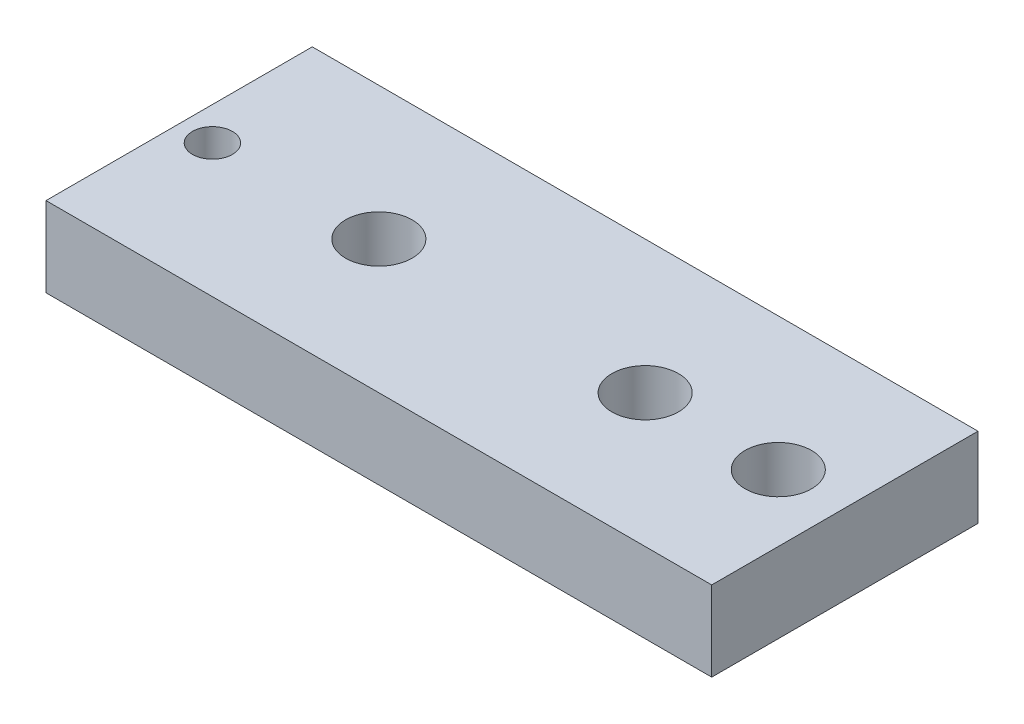
ISO-10303-21;
HEADER;
FILE_DESCRIPTION(('STEP AP214'),'2;1');
FILE_NAME('part.step','',(''),(''),'','','');
FILE_SCHEMA(('AUTOMOTIVE_DESIGN { 1 0 10303 214 1 1 1 1 }'));
ENDSEC;
DATA;
#1=APPLICATION_CONTEXT('core data for automotive mechanical design processes');
#2=APPLICATION_PROTOCOL_DEFINITION('international standard','automotive_design',2000,#1);
#3=PRODUCT_CONTEXT('',#1,'mechanical');
#4=PRODUCT('Part','Part','',(#3));
#5=PRODUCT_RELATED_PRODUCT_CATEGORY('part','',(#4));
#6=PRODUCT_DEFINITION_FORMATION('','',#4);
#7=PRODUCT_DEFINITION_CONTEXT('part definition',#1,'design');
#8=PRODUCT_DEFINITION('design','',#6,#7);
#9=PRODUCT_DEFINITION_SHAPE('','',#8);
#10=(LENGTH_UNIT() NAMED_UNIT(*) SI_UNIT(.MILLI.,.METRE.));
#11=(NAMED_UNIT(*) PLANE_ANGLE_UNIT() SI_UNIT($,.RADIAN.));
#12=(NAMED_UNIT(*) SI_UNIT($,.STERADIAN.) SOLID_ANGLE_UNIT());
#13=UNCERTAINTY_MEASURE_WITH_UNIT(LENGTH_MEASURE(1.E-05),#10,'distance_accuracy_value','');
#14=(GEOMETRIC_REPRESENTATION_CONTEXT(3) GLOBAL_UNCERTAINTY_ASSIGNED_CONTEXT((#13)) GLOBAL_UNIT_ASSIGNED_CONTEXT((#10,
#11,#12)) REPRESENTATION_CONTEXT('',''));
#15=CARTESIAN_POINT('',(0.,0.,0.));
#16=DIRECTION('',(0.,0.,1.));
#17=DIRECTION('',(1.,0.,0.));
#18=AXIS2_PLACEMENT_3D('',#15,#16,#17);
#19=CARTESIAN_POINT('',(-25.,6.,10.));
#20=DIRECTION('',(-1.,0.,0.));
#21=DIRECTION('',(0.,0.,1.));
#22=AXIS2_PLACEMENT_3D('',#19,#20,#21);
#23=PLANE('',#22);
#24=DIRECTION('',(0.,0.,-1.));
#25=VECTOR('',#24,1.);
#26=CARTESIAN_POINT('',(-25.,0.,10.));
#27=LINE('',#26,#25);
#28=CARTESIAN_POINT('',(-25.,0.,10.));
#29=VERTEX_POINT('',#28);
#30=CARTESIAN_POINT('',(-25.,0.,-10.));
#31=VERTEX_POINT('',#30);
#32=EDGE_CURVE('E99',#29,#31,#27,.T.);
#33=ORIENTED_EDGE('',*,*,#32,.F.);
#34=DIRECTION('',(0.,-1.,0.));
#35=VECTOR('',#34,1.);
#36=CARTESIAN_POINT('',(-25.,6.,10.));
#37=LINE('',#36,#35);
#38=CARTESIAN_POINT('',(-25.,6.,10.));
#39=VERTEX_POINT('',#38);
#40=EDGE_CURVE('E11',#39,#29,#37,.T.);
#41=ORIENTED_EDGE('',*,*,#40,.F.);
#42=DIRECTION('',(0.,0.,-1.));
#43=VECTOR('',#42,1.);
#44=CARTESIAN_POINT('',(-25.,6.,10.));
#45=LINE('',#44,#43);
#46=CARTESIAN_POINT('',(-25.,6.,-10.));
#47=VERTEX_POINT('',#46);
#48=EDGE_CURVE('E93',#39,#47,#45,.T.);
#49=ORIENTED_EDGE('',*,*,#48,.T.);
#50=DIRECTION('',(0.,-1.,0.));
#51=VECTOR('',#50,1.);
#52=CARTESIAN_POINT('',(-25.,6.,-10.));
#53=LINE('',#52,#51);
#54=EDGE_CURVE('E36',#47,#31,#53,.T.);
#55=ORIENTED_EDGE('',*,*,#54,.T.);
#56=EDGE_LOOP('',(#33,#41,#49,#55));
#57=FACE_BOUND('',#56,.T.);
#58=ADVANCED_FACE('F33',(#57),#23,.T.);
#59=CARTESIAN_POINT('',(-25.,6.,10.));
#60=DIRECTION('',(0.,0.,-1.));
#61=DIRECTION('',(-1.,0.,0.));
#62=AXIS2_PLACEMENT_3D('',#59,#60,#61);
#63=PLANE('',#62);
#64=DIRECTION('',(1.,0.,0.));
#65=VECTOR('',#64,1.);
#66=CARTESIAN_POINT('',(-25.,0.,10.));
#67=LINE('',#66,#65);
#68=CARTESIAN_POINT('',(25.,0.,10.));
#69=VERTEX_POINT('',#68);
#70=EDGE_CURVE('E66',#29,#69,#67,.T.);
#71=ORIENTED_EDGE('',*,*,#70,.T.);
#72=DIRECTION('',(0.,-1.,0.));
#73=VECTOR('',#72,1.);
#74=CARTESIAN_POINT('',(25.,6.,10.));
#75=LINE('',#74,#73);
#76=CARTESIAN_POINT('',(25.,6.,10.));
#77=VERTEX_POINT('',#76);
#78=EDGE_CURVE('E42',#77,#69,#75,.T.);
#79=ORIENTED_EDGE('',*,*,#78,.F.);
#80=DIRECTION('',(1.,0.,0.));
#81=VECTOR('',#80,1.);
#82=CARTESIAN_POINT('',(-25.,6.,10.));
#83=LINE('',#82,#81);
#84=EDGE_CURVE('E83',#39,#77,#83,.T.);
#85=ORIENTED_EDGE('',*,*,#84,.F.);
#86=ORIENTED_EDGE('',*,*,#40,.T.);
#87=EDGE_LOOP('',(#71,#79,#85,#86));
#88=FACE_BOUND('',#87,.T.);
#89=ADVANCED_FACE('F110',(#88),#63,.F.);
#90=CARTESIAN_POINT('',(25.,6.,10.));
#91=DIRECTION('',(-1.,0.,0.));
#92=DIRECTION('',(0.,0.,1.));
#93=AXIS2_PLACEMENT_3D('',#90,#91,#92);
#94=PLANE('',#93);
#95=DIRECTION('',(0.,0.,-1.));
#96=VECTOR('',#95,1.);
#97=CARTESIAN_POINT('',(25.,0.,10.));
#98=LINE('',#97,#96);
#99=CARTESIAN_POINT('',(25.,0.,-10.));
#100=VERTEX_POINT('',#99);
#101=EDGE_CURVE('E90',#69,#100,#98,.T.);
#102=ORIENTED_EDGE('',*,*,#101,.T.);
#103=DIRECTION('',(0.,-1.,0.));
#104=VECTOR('',#103,1.);
#105=CARTESIAN_POINT('',(25.,6.,-10.));
#106=LINE('',#105,#104);
#107=CARTESIAN_POINT('',(25.,6.,-10.));
#108=VERTEX_POINT('',#107);
#109=EDGE_CURVE('E87',#108,#100,#106,.T.);
#110=ORIENTED_EDGE('',*,*,#109,.F.);
#111=DIRECTION('',(0.,0.,-1.));
#112=VECTOR('',#111,1.);
#113=CARTESIAN_POINT('',(25.,6.,10.));
#114=LINE('',#113,#112);
#115=EDGE_CURVE('E78',#77,#108,#114,.T.);
#116=ORIENTED_EDGE('',*,*,#115,.F.);
#117=ORIENTED_EDGE('',*,*,#78,.T.);
#118=EDGE_LOOP('',(#102,#110,#116,#117));
#119=FACE_BOUND('',#118,.T.);
#120=ADVANCED_FACE('F88',(#119),#94,.F.);
#121=CARTESIAN_POINT('',(-25.,6.,-10.));
#122=DIRECTION('',(0.,0.,-1.));
#123=DIRECTION('',(-1.,0.,0.));
#124=AXIS2_PLACEMENT_3D('',#121,#122,#123);
#125=PLANE('',#124);
#126=DIRECTION('',(1.,0.,0.));
#127=VECTOR('',#126,1.);
#128=CARTESIAN_POINT('',(-25.,0.,-10.));
#129=LINE('',#128,#127);
#130=EDGE_CURVE('E102',#31,#100,#129,.T.);
#131=ORIENTED_EDGE('',*,*,#130,.F.);
#132=ORIENTED_EDGE('',*,*,#54,.F.);
#133=DIRECTION('',(1.,0.,0.));
#134=VECTOR('',#133,1.);
#135=CARTESIAN_POINT('',(-25.,6.,-10.));
#136=LINE('',#135,#134);
#137=EDGE_CURVE('E82',#47,#108,#136,.T.);
#138=ORIENTED_EDGE('',*,*,#137,.T.);
#139=ORIENTED_EDGE('',*,*,#109,.T.);
#140=EDGE_LOOP('',(#131,#132,#138,#139));
#141=FACE_BOUND('',#140,.T.);
#142=ADVANCED_FACE('F92',(#141),#125,.T.);
#143=CARTESIAN_POINT('',(0.,6.,0.));
#144=DIRECTION('',(0.,-1.,0.));
#145=DIRECTION('',(0.,0.,-1.));
#146=AXIS2_PLACEMENT_3D('',#143,#144,#145);
#147=PLANE('',#146);
#148=CARTESIAN_POINT('',(20.,6.,0.));
#149=DIRECTION('',(0.,1.,0.));
#150=DIRECTION('',(0.,0.,1.));
#151=AXIS2_PLACEMENT_3D('',#148,#149,#150);
#152=CIRCLE('',#151,2.5);
#153=CARTESIAN_POINT('',(20.,6.,2.5));
#154=VERTEX_POINT('',#153);
#155=EDGE_CURVE('E152',#154,#154,#152,.T.);
#156=ORIENTED_EDGE('',*,*,#155,.F.);
#157=EDGE_LOOP('',(#156));
#158=FACE_BOUND('',#157,.T.);
#159=CARTESIAN_POINT('',(10.,6.,0.));
#160=DIRECTION('',(0.,1.,0.));
#161=DIRECTION('',(0.,0.,1.));
#162=AXIS2_PLACEMENT_3D('',#159,#160,#161);
#163=CIRCLE('',#162,2.5);
#164=CARTESIAN_POINT('',(10.,6.,2.5));
#165=VERTEX_POINT('',#164);
#166=EDGE_CURVE('E156',#165,#165,#163,.T.);
#167=ORIENTED_EDGE('',*,*,#166,.F.);
#168=EDGE_LOOP('',(#167));
#169=FACE_BOUND('',#168,.T.);
#170=CARTESIAN_POINT('',(-10.,6.,0.));
#171=DIRECTION('',(0.,1.,0.));
#172=DIRECTION('',(0.,0.,1.));
#173=AXIS2_PLACEMENT_3D('',#170,#171,#172);
#174=CIRCLE('',#173,2.5);
#175=CARTESIAN_POINT('',(-10.,6.,2.5));
#176=VERTEX_POINT('',#175);
#177=EDGE_CURVE('E164',#176,#176,#174,.T.);
#178=ORIENTED_EDGE('',*,*,#177,.F.);
#179=EDGE_LOOP('',(#178));
#180=FACE_BOUND('',#179,.T.);
#181=CARTESIAN_POINT('',(-22.5,6.,0.));
#182=DIRECTION('',(0.,1.,0.));
#183=DIRECTION('',(0.,0.,1.));
#184=AXIS2_PLACEMENT_3D('',#181,#182,#183);
#185=CIRCLE('',#184,1.5);
#186=CARTESIAN_POINT('',(-22.5,6.,1.5));
#187=VERTEX_POINT('',#186);
#188=EDGE_CURVE('E103',#187,#187,#185,.T.);
#189=ORIENTED_EDGE('',*,*,#188,.F.);
#190=EDGE_LOOP('',(#189));
#191=FACE_BOUND('',#190,.T.);
#192=ORIENTED_EDGE('',*,*,#48,.F.);
#193=ORIENTED_EDGE('',*,*,#84,.T.);
#194=ORIENTED_EDGE('',*,*,#115,.T.);
#195=ORIENTED_EDGE('',*,*,#137,.F.);
#196=EDGE_LOOP('',(#192,#193,#194,#195));
#197=FACE_BOUND('',#196,.T.);
#198=ADVANCED_FACE('F81',(#158,#169,#180,#191,#197),#147,.F.);
#199=CARTESIAN_POINT('',(0.,0.,0.));
#200=DIRECTION('',(0.,-1.,0.));
#201=DIRECTION('',(0.,0.,-1.));
#202=AXIS2_PLACEMENT_3D('',#199,#200,#201);
#203=PLANE('',#202);
#204=CARTESIAN_POINT('',(20.,0.,0.));
#205=DIRECTION('',(0.,1.,0.));
#206=DIRECTION('',(0.,0.,1.));
#207=AXIS2_PLACEMENT_3D('',#204,#205,#206);
#208=CIRCLE('',#207,2.5);
#209=CARTESIAN_POINT('',(20.,0.,2.5));
#210=VERTEX_POINT('',#209);
#211=EDGE_CURVE('E155',#210,#210,#208,.T.);
#212=ORIENTED_EDGE('',*,*,#211,.T.);
#213=EDGE_LOOP('',(#212));
#214=FACE_BOUND('',#213,.T.);
#215=CARTESIAN_POINT('',(10.,0.,0.));
#216=DIRECTION('',(0.,1.,0.));
#217=DIRECTION('',(0.,0.,1.));
#218=AXIS2_PLACEMENT_3D('',#215,#216,#217);
#219=CIRCLE('',#218,2.5);
#220=CARTESIAN_POINT('',(10.,0.,2.5));
#221=VERTEX_POINT('',#220);
#222=EDGE_CURVE('E159',#221,#221,#219,.T.);
#223=ORIENTED_EDGE('',*,*,#222,.T.);
#224=EDGE_LOOP('',(#223));
#225=FACE_BOUND('',#224,.T.);
#226=CARTESIAN_POINT('',(-10.,0.,0.));
#227=DIRECTION('',(0.,1.,0.));
#228=DIRECTION('',(0.,0.,1.));
#229=AXIS2_PLACEMENT_3D('',#226,#227,#228);
#230=CIRCLE('',#229,2.5);
#231=CARTESIAN_POINT('',(-10.,0.,2.5));
#232=VERTEX_POINT('',#231);
#233=EDGE_CURVE('E166',#232,#232,#230,.T.);
#234=ORIENTED_EDGE('',*,*,#233,.T.);
#235=EDGE_LOOP('',(#234));
#236=FACE_BOUND('',#235,.T.);
#237=CARTESIAN_POINT('',(-22.5,0.,0.));
#238=DIRECTION('',(0.,1.,0.));
#239=DIRECTION('',(0.,0.,1.));
#240=AXIS2_PLACEMENT_3D('',#237,#238,#239);
#241=CIRCLE('',#240,1.5);
#242=CARTESIAN_POINT('',(-22.5,0.,1.5));
#243=VERTEX_POINT('',#242);
#244=EDGE_CURVE('E169',#243,#243,#241,.T.);
#245=ORIENTED_EDGE('',*,*,#244,.T.);
#246=EDGE_LOOP('',(#245));
#247=FACE_BOUND('',#246,.T.);
#248=ORIENTED_EDGE('',*,*,#32,.T.);
#249=ORIENTED_EDGE('',*,*,#130,.T.);
#250=ORIENTED_EDGE('',*,*,#101,.F.);
#251=ORIENTED_EDGE('',*,*,#70,.F.);
#252=EDGE_LOOP('',(#248,#249,#250,#251));
#253=FACE_BOUND('',#252,.T.);
#254=ADVANCED_FACE('F108',(#214,#225,#236,#247,#253),#203,.T.);
#255=CARTESIAN_POINT('',(-22.5,6.,0.));
#256=DIRECTION('',(0.,-1.,0.));
#257=DIRECTION('',(0.,0.,-1.));
#258=AXIS2_PLACEMENT_3D('',#255,#256,#257);
#259=CYLINDRICAL_SURFACE('',#258,1.5);
#260=ORIENTED_EDGE('',*,*,#188,.T.);
#261=EDGE_LOOP('',(#260));
#262=FACE_BOUND('',#261,.T.);
#263=ORIENTED_EDGE('',*,*,#244,.F.);
#264=EDGE_LOOP('',(#263));
#265=FACE_BOUND('',#264,.T.);
#266=ADVANCED_FACE('F129',(#262,#265),#259,.F.);
#267=CARTESIAN_POINT('',(-10.,6.,0.));
#268=DIRECTION('',(0.,-1.,0.));
#269=DIRECTION('',(0.,0.,-1.));
#270=AXIS2_PLACEMENT_3D('',#267,#268,#269);
#271=CYLINDRICAL_SURFACE('',#270,2.5);
#272=ORIENTED_EDGE('',*,*,#177,.T.);
#273=EDGE_LOOP('',(#272));
#274=FACE_BOUND('',#273,.T.);
#275=ORIENTED_EDGE('',*,*,#233,.F.);
#276=EDGE_LOOP('',(#275));
#277=FACE_BOUND('',#276,.T.);
#278=ADVANCED_FACE('F136',(#274,#277),#271,.F.);
#279=CARTESIAN_POINT('',(10.,6.,0.));
#280=DIRECTION('',(0.,-1.,0.));
#281=DIRECTION('',(0.,0.,-1.));
#282=AXIS2_PLACEMENT_3D('',#279,#280,#281);
#283=CYLINDRICAL_SURFACE('',#282,2.5);
#284=ORIENTED_EDGE('',*,*,#166,.T.);
#285=EDGE_LOOP('',(#284));
#286=FACE_BOUND('',#285,.T.);
#287=ORIENTED_EDGE('',*,*,#222,.F.);
#288=EDGE_LOOP('',(#287));
#289=FACE_BOUND('',#288,.T.);
#290=ADVANCED_FACE('F140',(#286,#289),#283,.F.);
#291=CARTESIAN_POINT('',(20.,6.,0.));
#292=DIRECTION('',(0.,-1.,0.));
#293=DIRECTION('',(0.,0.,-1.));
#294=AXIS2_PLACEMENT_3D('',#291,#292,#293);
#295=CYLINDRICAL_SURFACE('',#294,2.5);
#296=ORIENTED_EDGE('',*,*,#155,.T.);
#297=EDGE_LOOP('',(#296));
#298=FACE_BOUND('',#297,.T.);
#299=ORIENTED_EDGE('',*,*,#211,.F.);
#300=EDGE_LOOP('',(#299));
#301=FACE_BOUND('',#300,.T.);
#302=ADVANCED_FACE('F144',(#298,#301),#295,.F.);
#303=CLOSED_SHELL('',(#58,#89,#120,#142,#198,#254,#266,#278,#290,#302));
#304=MANIFOLD_SOLID_BREP('B2',#303);
#305=ADVANCED_BREP_SHAPE_REPRESENTATION('',(#18,#304),#14);
#306=SHAPE_DEFINITION_REPRESENTATION(#9,#305);
ENDSEC;
END-ISO-10303-21;
